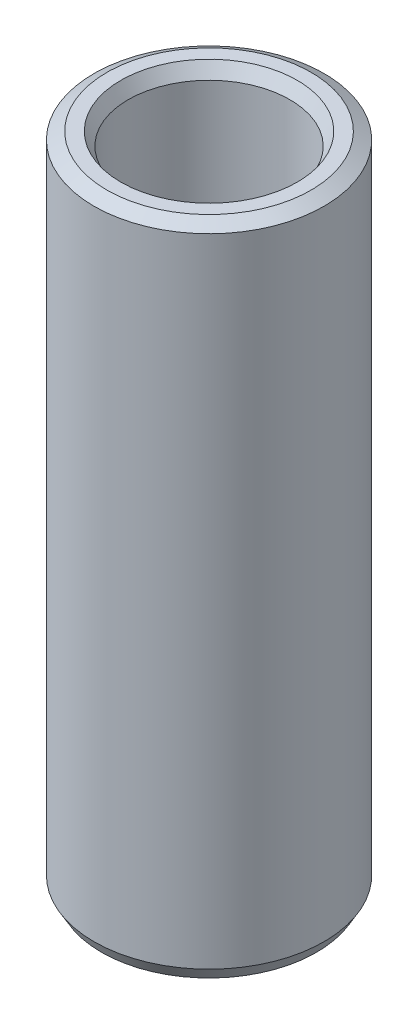
ISO-10303-21;
HEADER;
FILE_DESCRIPTION(('STEP AP214'),'2;1');
FILE_NAME('part.step','',(''),(''),'','','');
FILE_SCHEMA(('AUTOMOTIVE_DESIGN { 1 0 10303 214 1 1 1 1 }'));
ENDSEC;
DATA;
#1=APPLICATION_CONTEXT('core data for automotive mechanical design processes');
#2=APPLICATION_PROTOCOL_DEFINITION('international standard','automotive_design',2000,#1);
#3=PRODUCT_CONTEXT('',#1,'mechanical');
#4=PRODUCT('Part','Part','',(#3));
#5=PRODUCT_RELATED_PRODUCT_CATEGORY('part','',(#4));
#6=PRODUCT_DEFINITION_FORMATION('','',#4);
#7=PRODUCT_DEFINITION_CONTEXT('part definition',#1,'design');
#8=PRODUCT_DEFINITION('design','',#6,#7);
#9=PRODUCT_DEFINITION_SHAPE('','',#8);
#10=(LENGTH_UNIT() NAMED_UNIT(*) SI_UNIT(.MILLI.,.METRE.));
#11=(NAMED_UNIT(*) PLANE_ANGLE_UNIT() SI_UNIT($,.RADIAN.));
#12=(NAMED_UNIT(*) SI_UNIT($,.STERADIAN.) SOLID_ANGLE_UNIT());
#13=UNCERTAINTY_MEASURE_WITH_UNIT(LENGTH_MEASURE(1.E-05),#10,'distance_accuracy_value','');
#14=(GEOMETRIC_REPRESENTATION_CONTEXT(3) GLOBAL_UNCERTAINTY_ASSIGNED_CONTEXT((#13)) GLOBAL_UNIT_ASSIGNED_CONTEXT((#10,
#11,#12)) REPRESENTATION_CONTEXT('',''));
#15=CARTESIAN_POINT('',(0.,0.,0.));
#16=DIRECTION('',(0.,0.,1.));
#17=DIRECTION('',(1.,0.,0.));
#18=AXIS2_PLACEMENT_3D('',#15,#16,#17);
#19=CARTESIAN_POINT('',(0.,200.017951720133,0.));
#20=DIRECTION('',(0.,-1.,0.));
#21=DIRECTION('',(0.,0.,-1.));
#22=AXIS2_PLACEMENT_3D('',#19,#20,#21);
#23=CYLINDRICAL_SURFACE('',#22,35.);
#24=CARTESIAN_POINT('',(0.,3.93950984435218,0.));
#25=DIRECTION('',(0.,1.,0.));
#26=DIRECTION('',(0.,0.,1.));
#27=AXIS2_PLACEMENT_3D('',#24,#25,#26);
#28=CIRCLE('',#27,35.);
#29=CARTESIAN_POINT('',(0.,3.93950984435218,35.));
#30=VERTEX_POINT('',#29);
#31=EDGE_CURVE('E10',#30,#30,#28,.T.);
#32=ORIENTED_EDGE('',*,*,#31,.T.);
#33=EDGE_LOOP('',(#32));
#34=FACE_BOUND('',#33,.T.);
#35=CARTESIAN_POINT('',(0.,197.743474651022,0.));
#36=DIRECTION('',(0.,1.,0.));
#37=DIRECTION('',(0.,0.,1.));
#38=AXIS2_PLACEMENT_3D('',#35,#36,#37);
#39=CIRCLE('',#38,35.);
#40=CARTESIAN_POINT('',(0.,197.743474651022,35.));
#41=VERTEX_POINT('',#40);
#42=EDGE_CURVE('E50',#41,#41,#39,.F.);
#43=ORIENTED_EDGE('',*,*,#42,.T.);
#44=EDGE_LOOP('',(#43));
#45=FACE_BOUND('',#44,.T.);
#46=ADVANCED_FACE('F39',(#34,#45),#23,.T.);
#47=CARTESIAN_POINT('',(0.,200.017951720133,0.));
#48=DIRECTION('',(0.,1.,0.));
#49=DIRECTION('',(0.,0.,1.));
#50=AXIS2_PLACEMENT_3D('',#47,#48,#49);
#51=PLANE('',#50);
#52=CARTESIAN_POINT('',(0.,200.017951720133,0.));
#53=DIRECTION('',(0.,1.,0.));
#54=DIRECTION('',(0.,0.,1.));
#55=AXIS2_PLACEMENT_3D('',#52,#53,#54);
#56=CIRCLE('',#55,26.8470873526361);
#57=CARTESIAN_POINT('',(0.,200.017951720133,26.8470873526361));
#58=VERTEX_POINT('',#57);
#59=EDGE_CURVE('E58',#58,#58,#56,.F.);
#60=ORIENTED_EDGE('',*,*,#59,.T.);
#61=EDGE_LOOP('',(#60));
#62=FACE_BOUND('',#61,.T.);
#63=CARTESIAN_POINT('',(0.,200.017951720133,0.));
#64=DIRECTION('',(0.,1.,0.));
#65=DIRECTION('',(0.,0.,1.));
#66=AXIS2_PLACEMENT_3D('',#63,#64,#65);
#67=CIRCLE('',#66,31.0604901556479);
#68=CARTESIAN_POINT('',(0.,200.017951720133,31.0604901556479));
#69=VERTEX_POINT('',#68);
#70=EDGE_CURVE('E61',#69,#69,#67,.T.);
#71=ORIENTED_EDGE('',*,*,#70,.T.);
#72=EDGE_LOOP('',(#71));
#73=FACE_BOUND('',#72,.T.);
#74=ADVANCED_FACE('F88',(#62,#73),#51,.T.);
#75=CARTESIAN_POINT('',(0.,0.,0.));
#76=DIRECTION('',(0.,1.,0.));
#77=DIRECTION('',(0.,0.,1.));
#78=AXIS2_PLACEMENT_3D('',#75,#76,#77);
#79=PLANE('',#78);
#80=CARTESIAN_POINT('',(0.,0.,0.));
#81=DIRECTION('',(0.,1.,0.));
#82=DIRECTION('',(0.,0.,1.));
#83=AXIS2_PLACEMENT_3D('',#80,#81,#82);
#84=CIRCLE('',#83,28.5121201278764);
#85=CARTESIAN_POINT('',(0.,0.,28.5121201278764));
#86=VERTEX_POINT('',#85);
#87=EDGE_CURVE('E51',#86,#86,#84,.T.);
#88=ORIENTED_EDGE('',*,*,#87,.T.);
#89=EDGE_LOOP('',(#88));
#90=FACE_BOUND('',#89,.T.);
#91=CARTESIAN_POINT('',(0.,0.,0.));
#92=DIRECTION('',(0.,1.,0.));
#93=DIRECTION('',(0.,0.,1.));
#94=AXIS2_PLACEMENT_3D('',#91,#92,#93);
#95=CIRCLE('',#94,32.7255229308881);
#96=CARTESIAN_POINT('',(0.,0.,32.7255229308881));
#97=VERTEX_POINT('',#96);
#98=EDGE_CURVE('E54',#97,#97,#95,.F.);
#99=ORIENTED_EDGE('',*,*,#98,.T.);
#100=EDGE_LOOP('',(#99));
#101=FACE_BOUND('',#100,.T.);
#102=ADVANCED_FACE('F83',(#90,#101),#79,.F.);
#103=CARTESIAN_POINT('',(0.,200.017951720133,0.));
#104=DIRECTION('',(0.,-1.,0.));
#105=DIRECTION('',(0.,0.,-1.));
#106=AXIS2_PLACEMENT_3D('',#103,#104,#105);
#107=CYLINDRICAL_SURFACE('',#106,24.5726102835242);
#108=CARTESIAN_POINT('',(0.,196.078441875781,0.));
#109=DIRECTION('',(0.,1.,0.));
#110=DIRECTION('',(0.,0.,1.));
#111=AXIS2_PLACEMENT_3D('',#108,#109,#110);
#112=CIRCLE('',#111,24.5726102835242);
#113=CARTESIAN_POINT('',(0.,196.078441875781,24.5726102835242));
#114=VERTEX_POINT('',#113);
#115=EDGE_CURVE('E67',#114,#114,#112,.T.);
#116=ORIENTED_EDGE('',*,*,#115,.T.);
#117=EDGE_LOOP('',(#116));
#118=FACE_BOUND('',#117,.T.);
#119=CARTESIAN_POINT('',(0.,2.27447706911194,0.));
#120=DIRECTION('',(0.,1.,0.));
#121=DIRECTION('',(0.,0.,1.));
#122=AXIS2_PLACEMENT_3D('',#119,#120,#121);
#123=CIRCLE('',#122,24.5726102835242);
#124=CARTESIAN_POINT('',(0.,2.27447706911194,24.5726102835242));
#125=VERTEX_POINT('',#124);
#126=EDGE_CURVE('E69',#125,#125,#123,.F.);
#127=ORIENTED_EDGE('',*,*,#126,.T.);
#128=EDGE_LOOP('',(#127));
#129=FACE_BOUND('',#128,.T.);
#130=ADVANCED_FACE('F71',(#118,#129),#107,.F.);
#131=CARTESIAN_POINT('',(0.,196.078441875781,0.));
#132=DIRECTION('',(0.,1.,0.));
#133=DIRECTION('',(0.,0.,1.));
#134=AXIS2_PLACEMENT_3D('',#131,#132,#133);
#135=CONICAL_SURFACE('',#134,24.5726102835242,0.523598775598297);
#136=ORIENTED_EDGE('',*,*,#59,.F.);
#137=EDGE_LOOP('',(#136));
#138=FACE_BOUND('',#137,.T.);
#139=ORIENTED_EDGE('',*,*,#115,.F.);
#140=EDGE_LOOP('',(#139));
#141=FACE_BOUND('',#140,.T.);
#142=ADVANCED_FACE('F77',(#138,#141),#135,.F.);
#143=CARTESIAN_POINT('',(0.,0.,0.));
#144=DIRECTION('',(0.,-1.,0.));
#145=DIRECTION('',(0.,0.,-1.));
#146=AXIS2_PLACEMENT_3D('',#143,#144,#145);
#147=CONICAL_SURFACE('',#146,28.5121201278764,1.04719755119659);
#148=ORIENTED_EDGE('',*,*,#126,.F.);
#149=EDGE_LOOP('',(#148));
#150=FACE_BOUND('',#149,.T.);
#151=ORIENTED_EDGE('',*,*,#87,.F.);
#152=EDGE_LOOP('',(#151));
#153=FACE_BOUND('',#152,.T.);
#154=ADVANCED_FACE('F73',(#150,#153),#147,.F.);
#155=CARTESIAN_POINT('',(0.,3.93950984435218,0.));
#156=DIRECTION('',(0.,1.,0.));
#157=DIRECTION('',(0.,0.,1.));
#158=AXIS2_PLACEMENT_3D('',#155,#156,#157);
#159=CONICAL_SURFACE('',#158,35.,0.523598775598302);
#160=ORIENTED_EDGE('',*,*,#98,.F.);
#161=EDGE_LOOP('',(#160));
#162=FACE_BOUND('',#161,.T.);
#163=ORIENTED_EDGE('',*,*,#31,.F.);
#164=EDGE_LOOP('',(#163));
#165=FACE_BOUND('',#164,.T.);
#166=ADVANCED_FACE('F76',(#162,#165),#159,.T.);
#167=CARTESIAN_POINT('',(0.,200.017951720133,0.));
#168=DIRECTION('',(0.,-1.,0.));
#169=DIRECTION('',(0.,0.,-1.));
#170=AXIS2_PLACEMENT_3D('',#167,#168,#169);
#171=CONICAL_SURFACE('',#170,31.0604901556479,1.04719755119659);
#172=ORIENTED_EDGE('',*,*,#42,.F.);
#173=EDGE_LOOP('',(#172));
#174=FACE_BOUND('',#173,.T.);
#175=ORIENTED_EDGE('',*,*,#70,.F.);
#176=EDGE_LOOP('',(#175));
#177=FACE_BOUND('',#176,.T.);
#178=ADVANCED_FACE('F45',(#174,#177),#171,.T.);
#179=CLOSED_SHELL('',(#46,#74,#102,#130,#142,#154,#166,#178));
#180=MANIFOLD_SOLID_BREP('B2',#179);
#181=ADVANCED_BREP_SHAPE_REPRESENTATION('',(#18,#180),#14);
#182=SHAPE_DEFINITION_REPRESENTATION(#9,#181);
ENDSEC;
END-ISO-10303-21;
